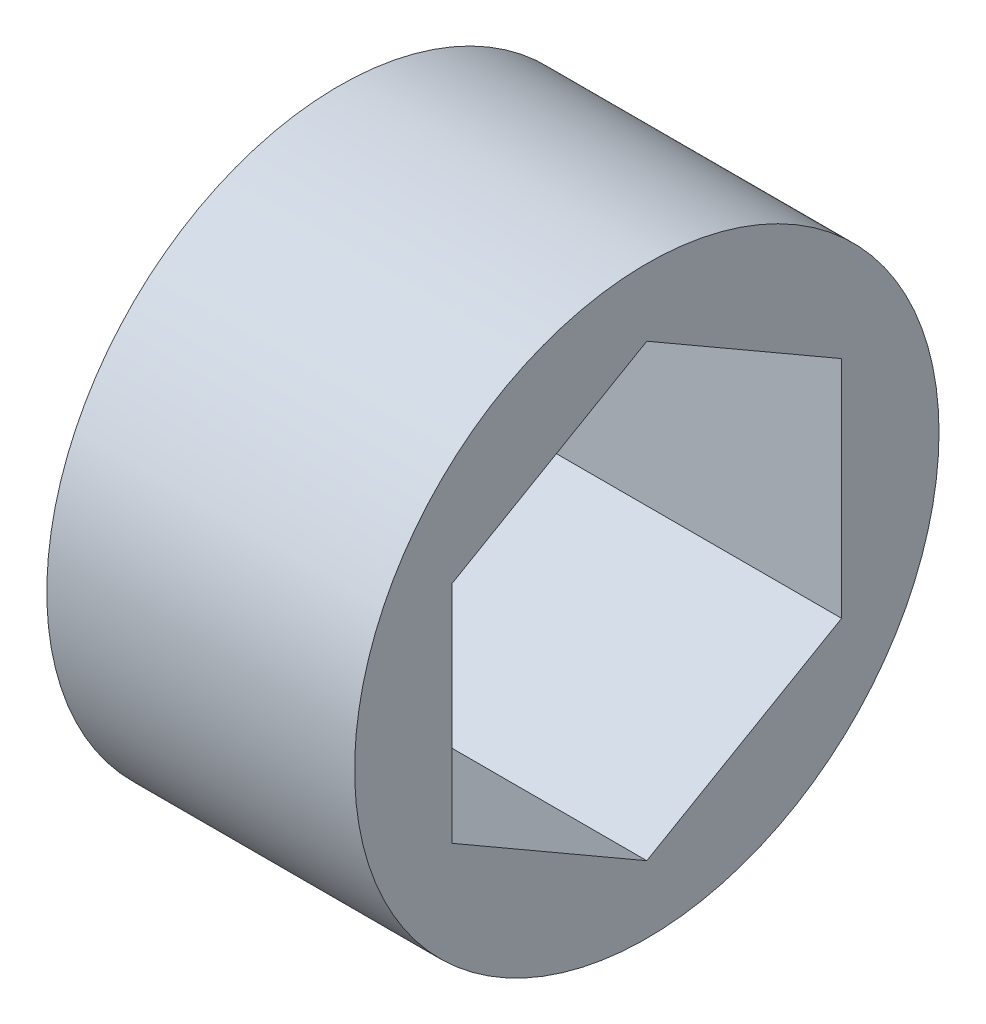
ISO-10303-21;
HEADER;
FILE_DESCRIPTION(('STEP AP214'),'2;1');
FILE_NAME('part.step','',(''),(''),'','','');
FILE_SCHEMA(('AUTOMOTIVE_DESIGN { 1 0 10303 214 1 1 1 1 }'));
ENDSEC;
DATA;
#1=APPLICATION_CONTEXT('core data for automotive mechanical design processes');
#2=APPLICATION_PROTOCOL_DEFINITION('international standard','automotive_design',2000,#1);
#3=PRODUCT_CONTEXT('',#1,'mechanical');
#4=PRODUCT('Part','Part','',(#3));
#5=PRODUCT_RELATED_PRODUCT_CATEGORY('part','',(#4));
#6=PRODUCT_DEFINITION_FORMATION('','',#4);
#7=PRODUCT_DEFINITION_CONTEXT('part definition',#1,'design');
#8=PRODUCT_DEFINITION('design','',#6,#7);
#9=PRODUCT_DEFINITION_SHAPE('','',#8);
#10=(LENGTH_UNIT() NAMED_UNIT(*) SI_UNIT(.MILLI.,.METRE.));
#11=(NAMED_UNIT(*) PLANE_ANGLE_UNIT() SI_UNIT($,.RADIAN.));
#12=(NAMED_UNIT(*) SI_UNIT($,.STERADIAN.) SOLID_ANGLE_UNIT());
#13=UNCERTAINTY_MEASURE_WITH_UNIT(LENGTH_MEASURE(1.E-05),#10,'distance_accuracy_value','');
#14=(GEOMETRIC_REPRESENTATION_CONTEXT(3) GLOBAL_UNCERTAINTY_ASSIGNED_CONTEXT((#13)) GLOBAL_UNIT_ASSIGNED_CONTEXT((#10,
#11,#12)) REPRESENTATION_CONTEXT('',''));
#15=CARTESIAN_POINT('',(0.,0.,0.));
#16=DIRECTION('',(0.,0.,1.));
#17=DIRECTION('',(1.,0.,0.));
#18=AXIS2_PLACEMENT_3D('',#15,#16,#17);
#19=CARTESIAN_POINT('',(10.033,0.,0.));
#20=DIRECTION('',(1.,0.,0.));
#21=DIRECTION('',(0.,0.,-1.));
#22=AXIS2_PLACEMENT_3D('',#19,#20,#21);
#23=PLANE('',#22);
#24=CARTESIAN_POINT('',(10.033,0.,0.));
#25=DIRECTION('',(1.,0.,0.));
#26=DIRECTION('',(0.,0.,-1.));
#27=AXIS2_PLACEMENT_3D('',#24,#25,#26);
#28=CIRCLE('',#27,9.525);
#29=CARTESIAN_POINT('',(10.033,0.,-9.525));
#30=VERTEX_POINT('',#29);
#31=EDGE_CURVE('E11',#30,#30,#28,.T.);
#32=ORIENTED_EDGE('',*,*,#31,.T.);
#33=EDGE_LOOP('',(#32));
#34=FACE_BOUND('',#33,.T.);
#35=DIRECTION('',(0.,-0.500000000000001,0.866025403784438));
#36=VECTOR('',#35,1.);
#37=CARTESIAN_POINT('',(10.033,7.33234841870825,0.));
#38=LINE('',#37,#36);
#39=CARTESIAN_POINT('',(10.033,7.33234841870825,0.));
#40=VERTEX_POINT('',#39);
#41=CARTESIAN_POINT('',(10.033,3.66617420935411,6.35000000000001));
#42=VERTEX_POINT('',#41);
#43=EDGE_CURVE('E94',#40,#42,#38,.T.);
#44=ORIENTED_EDGE('',*,*,#43,.F.);
#45=DIRECTION('',(0.,0.499999999999995,0.866025403784441));
#46=VECTOR('',#45,1.);
#47=CARTESIAN_POINT('',(10.033,3.6661742093542,-6.34999999999996));
#48=LINE('',#47,#46);
#49=CARTESIAN_POINT('',(10.033,3.6661742093542,-6.34999999999996));
#50=VERTEX_POINT('',#49);
#51=EDGE_CURVE('E86',#50,#40,#48,.T.);
#52=ORIENTED_EDGE('',*,*,#51,.F.);
#53=DIRECTION('',(0.,1.,0.));
#54=VECTOR('',#53,1.);
#55=CARTESIAN_POINT('',(10.033,-3.66617420935407,-6.35000000000004));
#56=LINE('',#55,#54);
#57=CARTESIAN_POINT('',(10.033,-3.66617420935407,-6.35000000000004));
#58=VERTEX_POINT('',#57);
#59=EDGE_CURVE('E114',#58,#50,#56,.T.);
#60=ORIENTED_EDGE('',*,*,#59,.F.);
#61=DIRECTION('',(0.,0.500000000000007,-0.866025403784435));
#62=VECTOR('',#61,1.);
#63=CARTESIAN_POINT('',(10.033,-7.33234841870825,0.));
#64=LINE('',#63,#62);
#65=CARTESIAN_POINT('',(10.033,-7.33234841870825,0.));
#66=VERTEX_POINT('',#65);
#67=EDGE_CURVE('E112',#66,#58,#64,.T.);
#68=ORIENTED_EDGE('',*,*,#67,.F.);
#69=DIRECTION('',(0.,-0.499999999999995,-0.866025403784442));
#70=VECTOR('',#69,1.);
#71=CARTESIAN_POINT('',(10.033,-3.66617420935416,6.34999999999999));
#72=LINE('',#71,#70);
#73=CARTESIAN_POINT('',(10.033,-3.66617420935416,6.34999999999999));
#74=VERTEX_POINT('',#73);
#75=EDGE_CURVE('E108',#74,#66,#72,.T.);
#76=ORIENTED_EDGE('',*,*,#75,.F.);
#77=DIRECTION('',(0.,-1.,0.));
#78=VECTOR('',#77,1.);
#79=CARTESIAN_POINT('',(10.033,3.66617420935411,6.35000000000001));
#80=LINE('',#79,#78);
#81=EDGE_CURVE('E106',#42,#74,#80,.T.);
#82=ORIENTED_EDGE('',*,*,#81,.F.);
#83=EDGE_LOOP('',(#44,#52,#60,#68,#76,#82));
#84=FACE_BOUND('',#83,.T.);
#85=ADVANCED_FACE('F33',(#34,#84),#23,.T.);
#86=CARTESIAN_POINT('',(0.,0.,0.));
#87=DIRECTION('',(1.,0.,0.));
#88=DIRECTION('',(0.,0.,-1.));
#89=AXIS2_PLACEMENT_3D('',#86,#87,#88);
#90=PLANE('',#89);
#91=CARTESIAN_POINT('',(0.,0.,0.));
#92=DIRECTION('',(1.,0.,0.));
#93=DIRECTION('',(0.,0.,-1.));
#94=AXIS2_PLACEMENT_3D('',#91,#92,#93);
#95=CIRCLE('',#94,9.525);
#96=CARTESIAN_POINT('',(0.,0.,-9.525));
#97=VERTEX_POINT('',#96);
#98=EDGE_CURVE('E37',#97,#97,#95,.T.);
#99=ORIENTED_EDGE('',*,*,#98,.F.);
#100=EDGE_LOOP('',(#99));
#101=FACE_BOUND('',#100,.T.);
#102=DIRECTION('',(0.,0.499999999999995,0.866025403784441));
#103=VECTOR('',#102,1.);
#104=CARTESIAN_POINT('',(0.,3.6661742093542,-6.34999999999996));
#105=LINE('',#104,#103);
#106=CARTESIAN_POINT('',(0.,3.6661742093542,-6.34999999999996));
#107=VERTEX_POINT('',#106);
#108=CARTESIAN_POINT('',(0.,7.33234841870825,0.));
#109=VERTEX_POINT('',#108);
#110=EDGE_CURVE('E56',#107,#109,#105,.T.);
#111=ORIENTED_EDGE('',*,*,#110,.T.);
#112=DIRECTION('',(0.,-0.500000000000001,0.866025403784438));
#113=VECTOR('',#112,1.);
#114=CARTESIAN_POINT('',(0.,7.33234841870825,0.));
#115=LINE('',#114,#113);
#116=CARTESIAN_POINT('',(0.,3.66617420935411,6.35000000000001));
#117=VERTEX_POINT('',#116);
#118=EDGE_CURVE('E101',#109,#117,#115,.T.);
#119=ORIENTED_EDGE('',*,*,#118,.T.);
#120=DIRECTION('',(0.,-1.,0.));
#121=VECTOR('',#120,1.);
#122=CARTESIAN_POINT('',(0.,3.66617420935411,6.35000000000001));
#123=LINE('',#122,#121);
#124=CARTESIAN_POINT('',(0.,-3.66617420935416,6.34999999999999));
#125=VERTEX_POINT('',#124);
#126=EDGE_CURVE('E118',#117,#125,#123,.T.);
#127=ORIENTED_EDGE('',*,*,#126,.T.);
#128=DIRECTION('',(0.,-0.499999999999995,-0.866025403784442));
#129=VECTOR('',#128,1.);
#130=CARTESIAN_POINT('',(0.,-3.66617420935416,6.34999999999999));
#131=LINE('',#130,#129);
#132=CARTESIAN_POINT('',(0.,-7.33234841870825,0.));
#133=VERTEX_POINT('',#132);
#134=EDGE_CURVE('E121',#125,#133,#131,.T.);
#135=ORIENTED_EDGE('',*,*,#134,.T.);
#136=DIRECTION('',(0.,0.500000000000007,-0.866025403784435));
#137=VECTOR('',#136,1.);
#138=CARTESIAN_POINT('',(0.,-7.33234841870825,0.));
#139=LINE('',#138,#137);
#140=CARTESIAN_POINT('',(0.,-3.66617420935407,-6.35000000000004));
#141=VERTEX_POINT('',#140);
#142=EDGE_CURVE('E124',#133,#141,#139,.T.);
#143=ORIENTED_EDGE('',*,*,#142,.T.);
#144=DIRECTION('',(0.,1.,0.));
#145=VECTOR('',#144,1.);
#146=CARTESIAN_POINT('',(0.,-3.66617420935407,-6.35000000000004));
#147=LINE('',#146,#145);
#148=EDGE_CURVE('E95',#141,#107,#147,.T.);
#149=ORIENTED_EDGE('',*,*,#148,.T.);
#150=EDGE_LOOP('',(#111,#119,#127,#135,#143,#149));
#151=FACE_BOUND('',#150,.T.);
#152=ADVANCED_FACE('F141',(#101,#151),#90,.F.);
#153=CARTESIAN_POINT('',(10.033,0.,0.));
#154=DIRECTION('',(-1.,0.,0.));
#155=DIRECTION('',(0.,0.,1.));
#156=AXIS2_PLACEMENT_3D('',#153,#154,#155);
#157=CYLINDRICAL_SURFACE('',#156,9.525);
#158=ORIENTED_EDGE('',*,*,#31,.F.);
#159=EDGE_LOOP('',(#158));
#160=FACE_BOUND('',#159,.T.);
#161=ORIENTED_EDGE('',*,*,#98,.T.);
#162=EDGE_LOOP('',(#161));
#163=FACE_BOUND('',#162,.T.);
#164=ADVANCED_FACE('F35',(#160,#163),#157,.T.);
#165=CARTESIAN_POINT('',(10.033,3.6661742093542,-6.34999999999996));
#166=DIRECTION('',(0.,-0.866025403784441,0.499999999999995));
#167=DIRECTION('',(0.,-0.499999999999995,-0.866025403784442));
#168=AXIS2_PLACEMENT_3D('',#165,#166,#167);
#169=PLANE('',#168);
#170=ORIENTED_EDGE('',*,*,#110,.F.);
#171=DIRECTION('',(-1.,0.,0.));
#172=VECTOR('',#171,1.);
#173=CARTESIAN_POINT('',(10.033,3.6661742093542,-6.34999999999996));
#174=LINE('',#173,#172);
#175=EDGE_CURVE('E90',#50,#107,#174,.T.);
#176=ORIENTED_EDGE('',*,*,#175,.F.);
#177=ORIENTED_EDGE('',*,*,#51,.T.);
#178=DIRECTION('',(-1.,0.,0.));
#179=VECTOR('',#178,1.);
#180=CARTESIAN_POINT('',(10.033,7.33234841870825,0.));
#181=LINE('',#180,#179);
#182=EDGE_CURVE('E89',#40,#109,#181,.T.);
#183=ORIENTED_EDGE('',*,*,#182,.T.);
#184=EDGE_LOOP('',(#170,#176,#177,#183));
#185=FACE_BOUND('',#184,.T.);
#186=ADVANCED_FACE('F88',(#185),#169,.T.);
#187=CARTESIAN_POINT('',(10.033,7.33234841870825,0.));
#188=DIRECTION('',(0.,-0.866025403784438,-0.500000000000001));
#189=DIRECTION('',(0.,0.500000000000001,-0.866025403784438));
#190=AXIS2_PLACEMENT_3D('',#187,#188,#189);
#191=PLANE('',#190);
#192=ORIENTED_EDGE('',*,*,#118,.F.);
#193=ORIENTED_EDGE('',*,*,#182,.F.);
#194=ORIENTED_EDGE('',*,*,#43,.T.);
#195=DIRECTION('',(-1.,0.,0.));
#196=VECTOR('',#195,1.);
#197=CARTESIAN_POINT('',(10.033,3.66617420935411,6.35000000000001));
#198=LINE('',#197,#196);
#199=EDGE_CURVE('E102',#42,#117,#198,.T.);
#200=ORIENTED_EDGE('',*,*,#199,.T.);
#201=EDGE_LOOP('',(#192,#193,#194,#200));
#202=FACE_BOUND('',#201,.T.);
#203=ADVANCED_FACE('F98',(#202),#191,.T.);
#204=CARTESIAN_POINT('',(10.033,3.66617420935411,6.35000000000001));
#205=DIRECTION('',(0.,0.,-1.));
#206=DIRECTION('',(0.,1.,0.));
#207=AXIS2_PLACEMENT_3D('',#204,#205,#206);
#208=PLANE('',#207);
#209=ORIENTED_EDGE('',*,*,#126,.F.);
#210=ORIENTED_EDGE('',*,*,#199,.F.);
#211=ORIENTED_EDGE('',*,*,#81,.T.);
#212=DIRECTION('',(-1.,0.,0.));
#213=VECTOR('',#212,1.);
#214=CARTESIAN_POINT('',(10.033,-3.66617420935416,6.34999999999999));
#215=LINE('',#214,#213);
#216=EDGE_CURVE('E133',#74,#125,#215,.T.);
#217=ORIENTED_EDGE('',*,*,#216,.T.);
#218=EDGE_LOOP('',(#209,#210,#211,#217));
#219=FACE_BOUND('',#218,.T.);
#220=ADVANCED_FACE('F137',(#219),#208,.T.);
#221=CARTESIAN_POINT('',(10.033,-3.66617420935416,6.34999999999999));
#222=DIRECTION('',(0.,0.866025403784442,-0.499999999999995));
#223=DIRECTION('',(0.,0.499999999999995,0.866025403784442));
#224=AXIS2_PLACEMENT_3D('',#221,#222,#223);
#225=PLANE('',#224);
#226=ORIENTED_EDGE('',*,*,#134,.F.);
#227=ORIENTED_EDGE('',*,*,#216,.F.);
#228=ORIENTED_EDGE('',*,*,#75,.T.);
#229=DIRECTION('',(-1.,0.,0.));
#230=VECTOR('',#229,1.);
#231=CARTESIAN_POINT('',(10.033,-7.33234841870825,0.));
#232=LINE('',#231,#230);
#233=EDGE_CURVE('E131',#66,#133,#232,.T.);
#234=ORIENTED_EDGE('',*,*,#233,.T.);
#235=EDGE_LOOP('',(#226,#227,#228,#234));
#236=FACE_BOUND('',#235,.T.);
#237=ADVANCED_FACE('F149',(#236),#225,.T.);
#238=CARTESIAN_POINT('',(10.033,-7.33234841870825,0.));
#239=DIRECTION('',(0.,0.866025403784435,0.500000000000007));
#240=DIRECTION('',(0.,-0.500000000000007,0.866025403784435));
#241=AXIS2_PLACEMENT_3D('',#238,#239,#240);
#242=PLANE('',#241);
#243=ORIENTED_EDGE('',*,*,#142,.F.);
#244=ORIENTED_EDGE('',*,*,#233,.F.);
#245=ORIENTED_EDGE('',*,*,#67,.T.);
#246=DIRECTION('',(-1.,0.,0.));
#247=VECTOR('',#246,1.);
#248=CARTESIAN_POINT('',(10.033,-3.66617420935407,-6.35000000000004));
#249=LINE('',#248,#247);
#250=EDGE_CURVE('E48',#58,#141,#249,.T.);
#251=ORIENTED_EDGE('',*,*,#250,.T.);
#252=EDGE_LOOP('',(#243,#244,#245,#251));
#253=FACE_BOUND('',#252,.T.);
#254=ADVANCED_FACE('F147',(#253),#242,.T.);
#255=CARTESIAN_POINT('',(10.033,-3.66617420935407,-6.35000000000004));
#256=DIRECTION('',(0.,0.,1.));
#257=DIRECTION('',(0.,-1.,0.));
#258=AXIS2_PLACEMENT_3D('',#255,#256,#257);
#259=PLANE('',#258);
#260=ORIENTED_EDGE('',*,*,#148,.F.);
#261=ORIENTED_EDGE('',*,*,#250,.F.);
#262=ORIENTED_EDGE('',*,*,#59,.T.);
#263=ORIENTED_EDGE('',*,*,#175,.T.);
#264=EDGE_LOOP('',(#260,#261,#262,#263));
#265=FACE_BOUND('',#264,.T.);
#266=ADVANCED_FACE('F143',(#265),#259,.T.);
#267=CLOSED_SHELL('',(#85,#152,#164,#186,#203,#220,#237,#254,#266));
#268=MANIFOLD_SOLID_BREP('B2',#267);
#269=ADVANCED_BREP_SHAPE_REPRESENTATION('',(#18,#268),#14);
#270=SHAPE_DEFINITION_REPRESENTATION(#9,#269);
ENDSEC;
END-ISO-10303-21;
